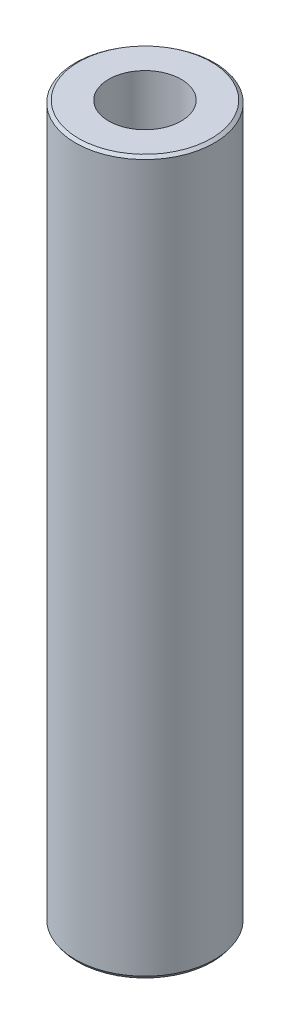
ISO-10303-21;
HEADER;
FILE_DESCRIPTION(('STEP AP214'),'2;1');
FILE_NAME('part.step','',(''),(''),'','','');
FILE_SCHEMA(('AUTOMOTIVE_DESIGN { 1 0 10303 214 1 1 1 1 }'));
ENDSEC;
DATA;
#1=APPLICATION_CONTEXT('core data for automotive mechanical design processes');
#2=APPLICATION_PROTOCOL_DEFINITION('international standard','automotive_design',2000,#1);
#3=PRODUCT_CONTEXT('',#1,'mechanical');
#4=PRODUCT('Part','Part','',(#3));
#5=PRODUCT_RELATED_PRODUCT_CATEGORY('part','',(#4));
#6=PRODUCT_DEFINITION_FORMATION('','',#4);
#7=PRODUCT_DEFINITION_CONTEXT('part definition',#1,'design');
#8=PRODUCT_DEFINITION('design','',#6,#7);
#9=PRODUCT_DEFINITION_SHAPE('','',#8);
#10=(LENGTH_UNIT() NAMED_UNIT(*) SI_UNIT(.MILLI.,.METRE.));
#11=(NAMED_UNIT(*) PLANE_ANGLE_UNIT() SI_UNIT($,.RADIAN.));
#12=(NAMED_UNIT(*) SI_UNIT($,.STERADIAN.) SOLID_ANGLE_UNIT());
#13=UNCERTAINTY_MEASURE_WITH_UNIT(LENGTH_MEASURE(1.E-05),#10,'distance_accuracy_value','');
#14=(GEOMETRIC_REPRESENTATION_CONTEXT(3) GLOBAL_UNCERTAINTY_ASSIGNED_CONTEXT((#13)) GLOBAL_UNIT_ASSIGNED_CONTEXT((#10,
#11,#12)) REPRESENTATION_CONTEXT('',''));
#15=CARTESIAN_POINT('',(0.,0.,0.));
#16=DIRECTION('',(0.,0.,1.));
#17=DIRECTION('',(1.,0.,0.));
#18=AXIS2_PLACEMENT_3D('',#15,#16,#17);
#19=CARTESIAN_POINT('',(0.,128.169900429924,0.));
#20=DIRECTION('',(0.,-1.,0.));
#21=DIRECTION('',(0.,0.,-1.));
#22=AXIS2_PLACEMENT_3D('',#19,#20,#21);
#23=CYLINDRICAL_SURFACE('',#22,12.5);
#24=CARTESIAN_POINT('',(0.,127.752661590358,0.));
#25=DIRECTION('',(0.,1.,0.));
#26=DIRECTION('',(0.,0.,1.));
#27=AXIS2_PLACEMENT_3D('',#24,#25,#26);
#28=CIRCLE('',#27,12.5);
#29=CARTESIAN_POINT('',(0.,127.752661590358,12.5));
#30=VERTEX_POINT('',#29);
#31=EDGE_CURVE('E50',#30,#30,#28,.F.);
#32=ORIENTED_EDGE('',*,*,#31,.T.);
#33=EDGE_LOOP('',(#32));
#34=FACE_BOUND('',#33,.T.);
#35=CARTESIAN_POINT('',(0.,0.571530754611665,0.));
#36=DIRECTION('',(0.,1.,0.));
#37=DIRECTION('',(0.,0.,1.));
#38=AXIS2_PLACEMENT_3D('',#35,#36,#37);
#39=CIRCLE('',#38,12.5);
#40=CARTESIAN_POINT('',(0.,0.571530754611665,12.5));
#41=VERTEX_POINT('',#40);
#42=EDGE_CURVE('E51',#41,#41,#39,.T.);
#43=ORIENTED_EDGE('',*,*,#42,.T.);
#44=EDGE_LOOP('',(#43));
#45=FACE_BOUND('',#44,.T.);
#46=ADVANCED_FACE('F39',(#34,#45),#23,.T.);
#47=CARTESIAN_POINT('',(0.,128.169900429924,0.));
#48=DIRECTION('',(0.,1.,0.));
#49=DIRECTION('',(0.,0.,1.));
#50=AXIS2_PLACEMENT_3D('',#47,#48,#49);
#51=PLANE('',#50);
#52=CARTESIAN_POINT('',(0.,128.169900429924,0.));
#53=DIRECTION('',(0.,1.,0.));
#54=DIRECTION('',(0.,0.,1.));
#55=AXIS2_PLACEMENT_3D('',#52,#53,#54);
#56=CIRCLE('',#55,11.9284692453883);
#57=CARTESIAN_POINT('',(0.,128.169900429924,11.9284692453883));
#58=VERTEX_POINT('',#57);
#59=EDGE_CURVE('E54',#58,#58,#56,.T.);
#60=ORIENTED_EDGE('',*,*,#59,.T.);
#61=EDGE_LOOP('',(#60));
#62=FACE_BOUND('',#61,.T.);
#63=CARTESIAN_POINT('',(0.,128.169900429924,0.));
#64=DIRECTION('',(0.,1.,0.));
#65=DIRECTION('',(0.,0.,1.));
#66=AXIS2_PLACEMENT_3D('',#63,#64,#65);
#67=CIRCLE('',#66,6.51831914835507);
#68=CARTESIAN_POINT('',(0.,128.169900429924,6.51831914835507));
#69=VERTEX_POINT('',#68);
#70=EDGE_CURVE('E58',#69,#69,#67,.T.);
#71=ORIENTED_EDGE('',*,*,#70,.F.);
#72=EDGE_LOOP('',(#71));
#73=FACE_BOUND('',#72,.T.);
#74=ADVANCED_FACE('F69',(#62,#73),#51,.T.);
#75=CARTESIAN_POINT('',(0.,0.,0.));
#76=DIRECTION('',(0.,1.,0.));
#77=DIRECTION('',(0.,0.,1.));
#78=AXIS2_PLACEMENT_3D('',#75,#76,#77);
#79=PLANE('',#78);
#80=CARTESIAN_POINT('',(0.,0.,0.));
#81=DIRECTION('',(0.,1.,0.));
#82=DIRECTION('',(0.,0.,1.));
#83=AXIS2_PLACEMENT_3D('',#80,#81,#82);
#84=CIRCLE('',#83,12.0827611604341);
#85=CARTESIAN_POINT('',(0.,0.,12.0827611604341));
#86=VERTEX_POINT('',#85);
#87=EDGE_CURVE('E10',#86,#86,#84,.F.);
#88=ORIENTED_EDGE('',*,*,#87,.T.);
#89=EDGE_LOOP('',(#88));
#90=FACE_BOUND('',#89,.T.);
#91=CARTESIAN_POINT('',(0.,0.,0.));
#92=DIRECTION('',(0.,1.,0.));
#93=DIRECTION('',(0.,0.,1.));
#94=AXIS2_PLACEMENT_3D('',#91,#92,#93);
#95=CIRCLE('',#94,6.51831914835507);
#96=CARTESIAN_POINT('',(0.,0.,6.51831914835507));
#97=VERTEX_POINT('',#96);
#98=EDGE_CURVE('E63',#97,#97,#95,.T.);
#99=ORIENTED_EDGE('',*,*,#98,.T.);
#100=EDGE_LOOP('',(#99));
#101=FACE_BOUND('',#100,.T.);
#102=ADVANCED_FACE('F75',(#90,#101),#79,.F.);
#103=CARTESIAN_POINT('',(0.,128.169900429924,0.));
#104=DIRECTION('',(0.,-1.,0.));
#105=DIRECTION('',(0.,0.,-1.));
#106=AXIS2_PLACEMENT_3D('',#103,#104,#105);
#107=CYLINDRICAL_SURFACE('',#106,6.51831914835507);
#108=ORIENTED_EDGE('',*,*,#70,.T.);
#109=EDGE_LOOP('',(#108));
#110=FACE_BOUND('',#109,.T.);
#111=ORIENTED_EDGE('',*,*,#98,.F.);
#112=EDGE_LOOP('',(#111));
#113=FACE_BOUND('',#112,.T.);
#114=ADVANCED_FACE('F70',(#110,#113),#107,.F.);
#115=CARTESIAN_POINT('',(0.,128.169900429924,0.));
#116=DIRECTION('',(0.,-1.,0.));
#117=DIRECTION('',(0.,0.,-1.));
#118=AXIS2_PLACEMENT_3D('',#115,#116,#117);
#119=CONICAL_SURFACE('',#118,11.9284692453883,0.94019415646431);
#120=ORIENTED_EDGE('',*,*,#31,.F.);
#121=EDGE_LOOP('',(#120));
#122=FACE_BOUND('',#121,.T.);
#123=ORIENTED_EDGE('',*,*,#59,.F.);
#124=EDGE_LOOP('',(#123));
#125=FACE_BOUND('',#124,.T.);
#126=ADVANCED_FACE('F81',(#122,#125),#119,.T.);
#127=CARTESIAN_POINT('',(0.,0.571530754611665,0.));
#128=DIRECTION('',(0.,1.,0.));
#129=DIRECTION('',(0.,0.,1.));
#130=AXIS2_PLACEMENT_3D('',#127,#128,#129);
#131=CONICAL_SURFACE('',#130,12.5,0.630602170330537);
#132=ORIENTED_EDGE('',*,*,#87,.F.);
#133=EDGE_LOOP('',(#132));
#134=FACE_BOUND('',#133,.T.);
#135=ORIENTED_EDGE('',*,*,#42,.F.);
#136=EDGE_LOOP('',(#135));
#137=FACE_BOUND('',#136,.T.);
#138=ADVANCED_FACE('F45',(#134,#137),#131,.T.);
#139=CLOSED_SHELL('',(#46,#74,#102,#114,#126,#138));
#140=MANIFOLD_SOLID_BREP('B2',#139);
#141=ADVANCED_BREP_SHAPE_REPRESENTATION('',(#18,#140),#14);
#142=SHAPE_DEFINITION_REPRESENTATION(#9,#141);
ENDSEC;
END-ISO-10303-21;
